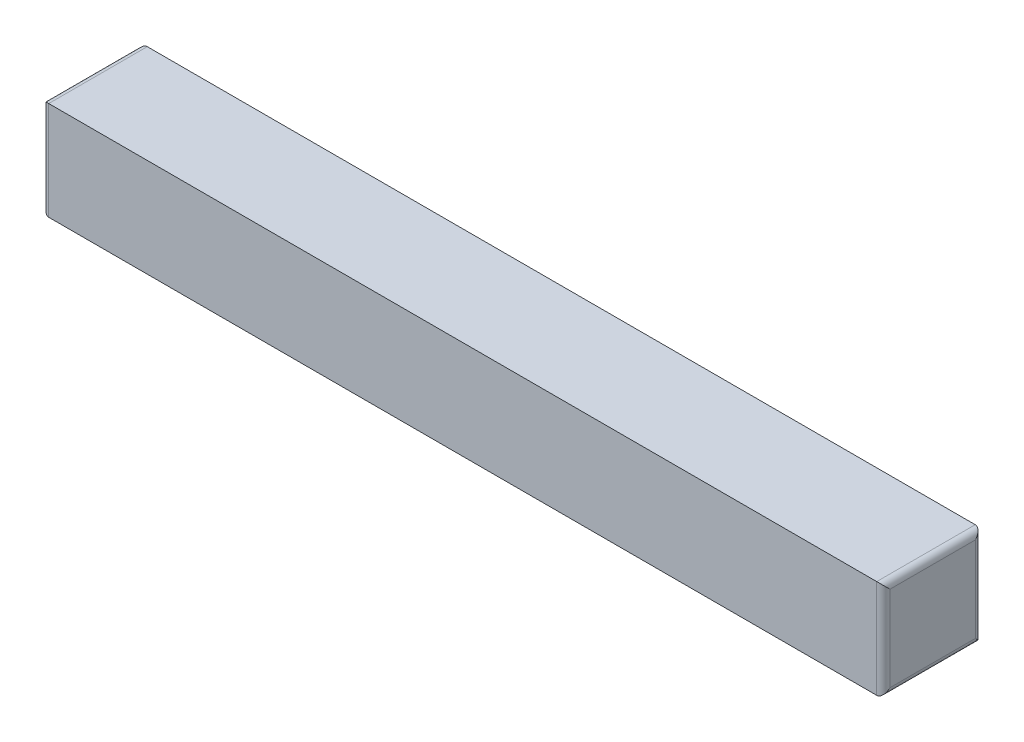
ISO-10303-21;
HEADER;
FILE_DESCRIPTION(('STEP AP214'),'2;1');
FILE_NAME('part.step','',(''),(''),'','','');
FILE_SCHEMA(('AUTOMOTIVE_DESIGN { 1 0 10303 214 1 1 1 1 }'));
ENDSEC;
DATA;
#1=APPLICATION_CONTEXT('core data for automotive mechanical design processes');
#2=APPLICATION_PROTOCOL_DEFINITION('international standard','automotive_design',2000,#1);
#3=PRODUCT_CONTEXT('',#1,'mechanical');
#4=PRODUCT('Part','Part','',(#3));
#5=PRODUCT_RELATED_PRODUCT_CATEGORY('part','',(#4));
#6=PRODUCT_DEFINITION_FORMATION('','',#4);
#7=PRODUCT_DEFINITION_CONTEXT('part definition',#1,'design');
#8=PRODUCT_DEFINITION('design','',#6,#7);
#9=PRODUCT_DEFINITION_SHAPE('','',#8);
#10=(LENGTH_UNIT() NAMED_UNIT(*) SI_UNIT(.MILLI.,.METRE.));
#11=(NAMED_UNIT(*) PLANE_ANGLE_UNIT() SI_UNIT($,.RADIAN.));
#12=(NAMED_UNIT(*) SI_UNIT($,.STERADIAN.) SOLID_ANGLE_UNIT());
#13=UNCERTAINTY_MEASURE_WITH_UNIT(LENGTH_MEASURE(1.E-05),#10,'distance_accuracy_value','');
#14=(GEOMETRIC_REPRESENTATION_CONTEXT(3) GLOBAL_UNCERTAINTY_ASSIGNED_CONTEXT((#13)) GLOBAL_UNIT_ASSIGNED_CONTEXT((#10,
#11,#12)) REPRESENTATION_CONTEXT('',''));
#15=CARTESIAN_POINT('',(0.,0.,0.));
#16=DIRECTION('',(0.,0.,1.));
#17=DIRECTION('',(1.,0.,0.));
#18=AXIS2_PLACEMENT_3D('',#15,#16,#17);
#19=CARTESIAN_POINT('',(0.,0.,2.975));
#20=DIRECTION('',(1.,0.,0.));
#21=DIRECTION('',(0.,1.,0.));
#22=AXIS2_PLACEMENT_3D('',#19,#20,#21);
#23=PLANE('',#22);
#24=DIRECTION('',(0.,0.,-1.));
#25=VECTOR('',#24,1.);
#26=CARTESIAN_POINT('',(0.,2.775,2.975));
#27=LINE('',#26,#25);
#28=CARTESIAN_POINT('',(0.,2.775,2.775));
#29=VERTEX_POINT('',#28);
#30=CARTESIAN_POINT('',(0.,2.775,0.2));
#31=VERTEX_POINT('',#30);
#32=EDGE_CURVE('E146',#29,#31,#27,.T.);
#33=ORIENTED_EDGE('',*,*,#32,.T.);
#34=DIRECTION('',(0.,-1.,0.));
#35=VECTOR('',#34,1.);
#36=CARTESIAN_POINT('',(0.,0.,0.2));
#37=LINE('',#36,#35);
#38=CARTESIAN_POINT('',(0.,0.2,0.2));
#39=VERTEX_POINT('',#38);
#40=EDGE_CURVE('E11',#31,#39,#37,.T.);
#41=ORIENTED_EDGE('',*,*,#40,.T.);
#42=DIRECTION('',(0.,0.,-1.));
#43=VECTOR('',#42,1.);
#44=CARTESIAN_POINT('',(0.,0.2,2.975));
#45=LINE('',#44,#43);
#46=CARTESIAN_POINT('',(0.,0.2,2.775));
#47=VERTEX_POINT('',#46);
#48=EDGE_CURVE('E42',#39,#47,#45,.F.);
#49=ORIENTED_EDGE('',*,*,#48,.T.);
#50=DIRECTION('',(0.,-1.,0.));
#51=VECTOR('',#50,1.);
#52=CARTESIAN_POINT('',(0.,0.,2.775));
#53=LINE('',#52,#51);
#54=EDGE_CURVE('E148',#47,#29,#53,.F.);
#55=ORIENTED_EDGE('',*,*,#54,.T.);
#56=EDGE_LOOP('',(#33,#41,#49,#55));
#57=FACE_BOUND('',#56,.T.);
#58=ADVANCED_FACE('F33',(#57),#23,.F.);
#59=CARTESIAN_POINT('',(0.,0.,2.975));
#60=DIRECTION('',(0.,1.,0.));
#61=DIRECTION('',(0.,0.,1.));
#62=AXIS2_PLACEMENT_3D('',#59,#60,#61);
#63=PLANE('',#62);
#64=DIRECTION('',(1.,0.,0.));
#65=VECTOR('',#64,1.);
#66=CARTESIAN_POINT('',(0.,0.,0.));
#67=LINE('',#66,#65);
#68=CARTESIAN_POINT('',(0.2,0.,0.));
#69=VERTEX_POINT('',#68);
#70=CARTESIAN_POINT('',(25.2,0.,0.));
#71=VERTEX_POINT('',#70);
#72=EDGE_CURVE('E156',#69,#71,#67,.T.);
#73=ORIENTED_EDGE('',*,*,#72,.T.);
#74=DIRECTION('',(0.,0.,-1.));
#75=VECTOR('',#74,1.);
#76=CARTESIAN_POINT('',(25.2,0.,2.975));
#77=LINE('',#76,#75);
#78=CARTESIAN_POINT('',(25.2,0.,2.975));
#79=VERTEX_POINT('',#78);
#80=EDGE_CURVE('E136',#71,#79,#77,.F.);
#81=ORIENTED_EDGE('',*,*,#80,.T.);
#82=DIRECTION('',(1.,0.,0.));
#83=VECTOR('',#82,1.);
#84=CARTESIAN_POINT('',(0.,0.,2.975));
#85=LINE('',#84,#83);
#86=CARTESIAN_POINT('',(0.2,0.,2.975));
#87=VERTEX_POINT('',#86);
#88=EDGE_CURVE('E178',#87,#79,#85,.T.);
#89=ORIENTED_EDGE('',*,*,#88,.F.);
#90=DIRECTION('',(0.,0.,-1.));
#91=VECTOR('',#90,1.);
#92=CARTESIAN_POINT('',(0.2,0.,2.975));
#93=LINE('',#92,#91);
#94=EDGE_CURVE('E134',#87,#69,#93,.T.);
#95=ORIENTED_EDGE('',*,*,#94,.T.);
#96=EDGE_LOOP('',(#73,#81,#89,#95));
#97=FACE_BOUND('',#96,.T.);
#98=ADVANCED_FACE('F183',(#97),#63,.F.);
#99=CARTESIAN_POINT('',(25.4,0.,2.975));
#100=DIRECTION('',(-1.,0.,0.));
#101=DIRECTION('',(0.,-1.,0.));
#102=AXIS2_PLACEMENT_3D('',#99,#100,#101);
#103=PLANE('',#102);
#104=DIRECTION('',(0.,0.,-1.));
#105=VECTOR('',#104,1.);
#106=CARTESIAN_POINT('',(25.4,0.2,2.975));
#107=LINE('',#106,#105);
#108=CARTESIAN_POINT('',(25.4,0.2,2.775));
#109=VERTEX_POINT('',#108);
#110=CARTESIAN_POINT('',(25.4,0.2,0.2));
#111=VERTEX_POINT('',#110);
#112=EDGE_CURVE('E124',#109,#111,#107,.T.);
#113=ORIENTED_EDGE('',*,*,#112,.T.);
#114=DIRECTION('',(0.,1.,0.));
#115=VECTOR('',#114,1.);
#116=CARTESIAN_POINT('',(25.4,2.975,0.2));
#117=LINE('',#116,#115);
#118=CARTESIAN_POINT('',(25.4,2.775,0.2));
#119=VERTEX_POINT('',#118);
#120=EDGE_CURVE('E105',#111,#119,#117,.T.);
#121=ORIENTED_EDGE('',*,*,#120,.T.);
#122=DIRECTION('',(0.,0.,-1.));
#123=VECTOR('',#122,1.);
#124=CARTESIAN_POINT('',(25.4,2.775,2.975));
#125=LINE('',#124,#123);
#126=CARTESIAN_POINT('',(25.4,2.775,2.775));
#127=VERTEX_POINT('',#126);
#128=EDGE_CURVE('E113',#119,#127,#125,.F.);
#129=ORIENTED_EDGE('',*,*,#128,.T.);
#130=DIRECTION('',(0.,1.,0.));
#131=VECTOR('',#130,1.);
#132=CARTESIAN_POINT('',(25.4,0.,2.775));
#133=LINE('',#132,#131);
#134=EDGE_CURVE('E119',#127,#109,#133,.F.);
#135=ORIENTED_EDGE('',*,*,#134,.T.);
#136=EDGE_LOOP('',(#113,#121,#129,#135));
#137=FACE_BOUND('',#136,.T.);
#138=ADVANCED_FACE('F122',(#137),#103,.F.);
#139=CARTESIAN_POINT('',(0.,2.975,2.975));
#140=DIRECTION('',(0.,-1.,0.));
#141=DIRECTION('',(0.,0.,-1.));
#142=AXIS2_PLACEMENT_3D('',#139,#140,#141);
#143=PLANE('',#142);
#144=DIRECTION('',(-1.,0.,0.));
#145=VECTOR('',#144,1.);
#146=CARTESIAN_POINT('',(0.,2.975,2.975));
#147=LINE('',#146,#145);
#148=CARTESIAN_POINT('',(25.2,2.975,2.975));
#149=VERTEX_POINT('',#148);
#150=CARTESIAN_POINT('',(0.199999999999997,2.975,2.975));
#151=VERTEX_POINT('',#150);
#152=EDGE_CURVE('E120',#149,#151,#147,.T.);
#153=ORIENTED_EDGE('',*,*,#152,.F.);
#154=DIRECTION('',(0.,0.,-1.));
#155=VECTOR('',#154,1.);
#156=CARTESIAN_POINT('',(25.2,2.975,2.975));
#157=LINE('',#156,#155);
#158=CARTESIAN_POINT('',(25.2,2.975,0.));
#159=VERTEX_POINT('',#158);
#160=EDGE_CURVE('E144',#149,#159,#157,.T.);
#161=ORIENTED_EDGE('',*,*,#160,.T.);
#162=DIRECTION('',(-1.,0.,0.));
#163=VECTOR('',#162,1.);
#164=CARTESIAN_POINT('',(0.,2.975,0.));
#165=LINE('',#164,#163);
#166=CARTESIAN_POINT('',(0.199999999999997,2.975,0.));
#167=VERTEX_POINT('',#166);
#168=EDGE_CURVE('E186',#159,#167,#165,.T.);
#169=ORIENTED_EDGE('',*,*,#168,.T.);
#170=DIRECTION('',(0.,0.,-1.));
#171=VECTOR('',#170,1.);
#172=CARTESIAN_POINT('',(0.199999999999997,2.975,2.975));
#173=LINE('',#172,#171);
#174=EDGE_CURVE('E142',#167,#151,#173,.F.);
#175=ORIENTED_EDGE('',*,*,#174,.T.);
#176=EDGE_LOOP('',(#153,#161,#169,#175));
#177=FACE_BOUND('',#176,.T.);
#178=ADVANCED_FACE('F201',(#177),#143,.F.);
#179=CARTESIAN_POINT('',(0.,0.,2.975));
#180=DIRECTION('',(0.,0.,-1.));
#181=DIRECTION('',(-1.,0.,0.));
#182=AXIS2_PLACEMENT_3D('',#179,#180,#181);
#183=PLANE('',#182);
#184=ORIENTED_EDGE('',*,*,#88,.T.);
#185=DIRECTION('',(0.,1.,0.));
#186=VECTOR('',#185,1.);
#187=CARTESIAN_POINT('',(25.2,0.,2.975));
#188=LINE('',#187,#186);
#189=EDGE_CURVE('E140',#79,#149,#188,.T.);
#190=ORIENTED_EDGE('',*,*,#189,.T.);
#191=ORIENTED_EDGE('',*,*,#152,.T.);
#192=DIRECTION('',(0.,-1.,0.));
#193=VECTOR('',#192,1.);
#194=CARTESIAN_POINT('',(0.2,0.,2.975));
#195=LINE('',#194,#193);
#196=EDGE_CURVE('E138',#151,#87,#195,.T.);
#197=ORIENTED_EDGE('',*,*,#196,.T.);
#198=EDGE_LOOP('',(#184,#190,#191,#197));
#199=FACE_BOUND('',#198,.T.);
#200=ADVANCED_FACE('F177',(#199),#183,.F.);
#201=CARTESIAN_POINT('',(0.,0.,0.));
#202=DIRECTION('',(0.,0.,-1.));
#203=DIRECTION('',(-1.,0.,0.));
#204=AXIS2_PLACEMENT_3D('',#201,#202,#203);
#205=PLANE('',#204);
#206=ORIENTED_EDGE('',*,*,#168,.F.);
#207=DIRECTION('',(0.,1.,0.));
#208=VECTOR('',#207,1.);
#209=CARTESIAN_POINT('',(25.2,0.,0.));
#210=LINE('',#209,#208);
#211=EDGE_CURVE('E107',#159,#71,#210,.F.);
#212=ORIENTED_EDGE('',*,*,#211,.T.);
#213=ORIENTED_EDGE('',*,*,#72,.F.);
#214=DIRECTION('',(0.,-1.,0.));
#215=VECTOR('',#214,1.);
#216=CARTESIAN_POINT('',(0.199999999999997,2.975,0.));
#217=LINE('',#216,#215);
#218=EDGE_CURVE('E126',#69,#167,#217,.F.);
#219=ORIENTED_EDGE('',*,*,#218,.T.);
#220=EDGE_LOOP('',(#206,#212,#213,#219));
#221=FACE_BOUND('',#220,.T.);
#222=ADVANCED_FACE('F199',(#221),#205,.T.);
#223=CARTESIAN_POINT('',(25.2,0.,2.775));
#224=DIRECTION('',(0.,1.,0.));
#225=DIRECTION('',(-1.,0.,0.));
#226=AXIS2_PLACEMENT_3D('',#223,#224,#225);
#227=CYLINDRICAL_SURFACE('',#226,0.2);
#228=CARTESIAN_POINT('',(25.2,2.775,2.775));
#229=DIRECTION('',(0.,0.707106781186547,-0.707106781186547));
#230=DIRECTION('',(0.,-0.707106781186547,-0.707106781186547));
#231=AXIS2_PLACEMENT_3D('',#228,#229,#230);
#232=ELLIPSE('',#231,0.282842712474619,0.2);
#233=EDGE_CURVE('E116',#149,#127,#232,.T.);
#234=ORIENTED_EDGE('',*,*,#233,.F.);
#235=ORIENTED_EDGE('',*,*,#189,.F.);
#236=CARTESIAN_POINT('',(25.2,0.2,2.775));
#237=DIRECTION('',(0.,0.707106781186547,0.707106781186547));
#238=DIRECTION('',(0.,0.707106781186547,-0.707106781186547));
#239=AXIS2_PLACEMENT_3D('',#236,#237,#238);
#240=ELLIPSE('',#239,0.282842712474619,0.2);
#241=EDGE_CURVE('E153',#109,#79,#240,.F.);
#242=ORIENTED_EDGE('',*,*,#241,.F.);
#243=ORIENTED_EDGE('',*,*,#134,.F.);
#244=EDGE_LOOP('',(#234,#235,#242,#243));
#245=FACE_BOUND('',#244,.T.);
#246=ADVANCED_FACE('F194',(#245),#227,.T.);
#247=CARTESIAN_POINT('',(25.2,0.2,2.975));
#248=DIRECTION('',(0.,0.,-1.));
#249=DIRECTION('',(-1.,0.,0.));
#250=AXIS2_PLACEMENT_3D('',#247,#248,#249);
#251=CYLINDRICAL_SURFACE('',#250,0.2);
#252=ORIENTED_EDGE('',*,*,#241,.T.);
#253=ORIENTED_EDGE('',*,*,#80,.F.);
#254=CARTESIAN_POINT('',(25.2,0.2,0.2));
#255=DIRECTION('',(0.,0.707106781186547,-0.707106781186547));
#256=DIRECTION('',(0.,-0.707106781186547,-0.707106781186547));
#257=AXIS2_PLACEMENT_3D('',#254,#255,#256);
#258=ELLIPSE('',#257,0.282842712474619,0.2);
#259=EDGE_CURVE('E110',#111,#71,#258,.T.);
#260=ORIENTED_EDGE('',*,*,#259,.F.);
#261=ORIENTED_EDGE('',*,*,#112,.F.);
#262=EDGE_LOOP('',(#252,#253,#260,#261));
#263=FACE_BOUND('',#262,.T.);
#264=ADVANCED_FACE('F196',(#263),#251,.T.);
#265=CARTESIAN_POINT('',(25.2,2.775,2.975));
#266=DIRECTION('',(0.,0.,-1.));
#267=DIRECTION('',(-1.,0.,0.));
#268=AXIS2_PLACEMENT_3D('',#265,#266,#267);
#269=CYLINDRICAL_SURFACE('',#268,0.2);
#270=ORIENTED_EDGE('',*,*,#233,.T.);
#271=ORIENTED_EDGE('',*,*,#128,.F.);
#272=CARTESIAN_POINT('',(25.2,2.775,0.2));
#273=DIRECTION('',(0.,-0.707106781186547,-0.707106781186547));
#274=DIRECTION('',(0.,0.707106781186547,-0.707106781186547));
#275=AXIS2_PLACEMENT_3D('',#272,#273,#274);
#276=ELLIPSE('',#275,0.282842712474619,0.2);
#277=EDGE_CURVE('E101',#159,#119,#276,.T.);
#278=ORIENTED_EDGE('',*,*,#277,.F.);
#279=ORIENTED_EDGE('',*,*,#160,.F.);
#280=EDGE_LOOP('',(#270,#271,#278,#279));
#281=FACE_BOUND('',#280,.T.);
#282=ADVANCED_FACE('F114',(#281),#269,.T.);
#283=CARTESIAN_POINT('',(25.2,0.,0.2));
#284=DIRECTION('',(0.,-1.,0.));
#285=DIRECTION('',(1.,0.,0.));
#286=AXIS2_PLACEMENT_3D('',#283,#284,#285);
#287=CYLINDRICAL_SURFACE('',#286,0.2);
#288=ORIENTED_EDGE('',*,*,#259,.T.);
#289=ORIENTED_EDGE('',*,*,#211,.F.);
#290=ORIENTED_EDGE('',*,*,#277,.T.);
#291=ORIENTED_EDGE('',*,*,#120,.F.);
#292=EDGE_LOOP('',(#288,#289,#290,#291));
#293=FACE_BOUND('',#292,.T.);
#294=ADVANCED_FACE('F103',(#293),#287,.T.);
#295=CARTESIAN_POINT('',(0.2,0.,2.775));
#296=DIRECTION('',(0.,-1.,0.));
#297=DIRECTION('',(1.,0.,0.));
#298=AXIS2_PLACEMENT_3D('',#295,#296,#297);
#299=CYLINDRICAL_SURFACE('',#298,0.2);
#300=CARTESIAN_POINT('',(0.2,0.2,2.775));
#301=DIRECTION('',(0.,-0.707106781186547,-0.707106781186547));
#302=DIRECTION('',(0.,-0.707106781186547,0.707106781186547));
#303=AXIS2_PLACEMENT_3D('',#300,#301,#302);
#304=ELLIPSE('',#303,0.282842712474619,0.2);
#305=EDGE_CURVE('E159',#87,#47,#304,.T.);
#306=ORIENTED_EDGE('',*,*,#305,.F.);
#307=ORIENTED_EDGE('',*,*,#196,.F.);
#308=CARTESIAN_POINT('',(0.199999999999997,2.775,2.775));
#309=DIRECTION('',(0.,0.707106781186547,-0.707106781186547));
#310=DIRECTION('',(0.,-0.707106781186547,-0.707106781186547));
#311=AXIS2_PLACEMENT_3D('',#308,#309,#310);
#312=ELLIPSE('',#311,0.282842712474619,0.2);
#313=EDGE_CURVE('E37',#29,#151,#312,.T.);
#314=ORIENTED_EDGE('',*,*,#313,.F.);
#315=ORIENTED_EDGE('',*,*,#54,.F.);
#316=EDGE_LOOP('',(#306,#307,#314,#315));
#317=FACE_BOUND('',#316,.T.);
#318=ADVANCED_FACE('F35',(#317),#299,.T.);
#319=CARTESIAN_POINT('',(0.199999999999997,2.775,2.975));
#320=DIRECTION('',(0.,0.,-1.));
#321=DIRECTION('',(-1.,0.,0.));
#322=AXIS2_PLACEMENT_3D('',#319,#320,#321);
#323=CYLINDRICAL_SURFACE('',#322,0.2);
#324=ORIENTED_EDGE('',*,*,#313,.T.);
#325=ORIENTED_EDGE('',*,*,#174,.F.);
#326=CARTESIAN_POINT('',(0.199999999999997,2.775,0.2));
#327=DIRECTION('',(0.,-0.707106781186547,-0.707106781186547));
#328=DIRECTION('',(0.,0.707106781186547,-0.707106781186547));
#329=AXIS2_PLACEMENT_3D('',#326,#327,#328);
#330=ELLIPSE('',#329,0.282842712474619,0.2);
#331=EDGE_CURVE('E158',#31,#167,#330,.T.);
#332=ORIENTED_EDGE('',*,*,#331,.F.);
#333=ORIENTED_EDGE('',*,*,#32,.F.);
#334=EDGE_LOOP('',(#324,#325,#332,#333));
#335=FACE_BOUND('',#334,.T.);
#336=ADVANCED_FACE('F169',(#335),#323,.T.);
#337=CARTESIAN_POINT('',(0.2,0.2,2.975));
#338=DIRECTION('',(0.,0.,-1.));
#339=DIRECTION('',(-1.,0.,0.));
#340=AXIS2_PLACEMENT_3D('',#337,#338,#339);
#341=CYLINDRICAL_SURFACE('',#340,0.2);
#342=ORIENTED_EDGE('',*,*,#305,.T.);
#343=ORIENTED_EDGE('',*,*,#48,.F.);
#344=CARTESIAN_POINT('',(0.2,0.2,0.2));
#345=DIRECTION('',(0.,0.707106781186547,-0.707106781186547));
#346=DIRECTION('',(0.,-0.707106781186547,-0.707106781186547));
#347=AXIS2_PLACEMENT_3D('',#344,#345,#346);
#348=ELLIPSE('',#347,0.282842712474619,0.2);
#349=EDGE_CURVE('E50',#69,#39,#348,.T.);
#350=ORIENTED_EDGE('',*,*,#349,.F.);
#351=ORIENTED_EDGE('',*,*,#94,.F.);
#352=EDGE_LOOP('',(#342,#343,#350,#351));
#353=FACE_BOUND('',#352,.T.);
#354=ADVANCED_FACE('F229',(#353),#341,.T.);
#355=CARTESIAN_POINT('',(0.2,0.,0.2));
#356=DIRECTION('',(0.,1.,0.));
#357=DIRECTION('',(-1.,0.,0.));
#358=AXIS2_PLACEMENT_3D('',#355,#356,#357);
#359=CYLINDRICAL_SURFACE('',#358,0.2);
#360=ORIENTED_EDGE('',*,*,#331,.T.);
#361=ORIENTED_EDGE('',*,*,#218,.F.);
#362=ORIENTED_EDGE('',*,*,#349,.T.);
#363=ORIENTED_EDGE('',*,*,#40,.F.);
#364=EDGE_LOOP('',(#360,#361,#362,#363));
#365=FACE_BOUND('',#364,.T.);
#366=ADVANCED_FACE('F226',(#365),#359,.T.);
#367=CLOSED_SHELL('',(#58,#98,#138,#178,#200,#222,#246,#264,#282,#294,#318,#336,#354,#366));
#368=MANIFOLD_SOLID_BREP('B2',#367);
#369=ADVANCED_BREP_SHAPE_REPRESENTATION('',(#18,#368),#14);
#370=SHAPE_DEFINITION_REPRESENTATION(#9,#369);
ENDSEC;
END-ISO-10303-21;
